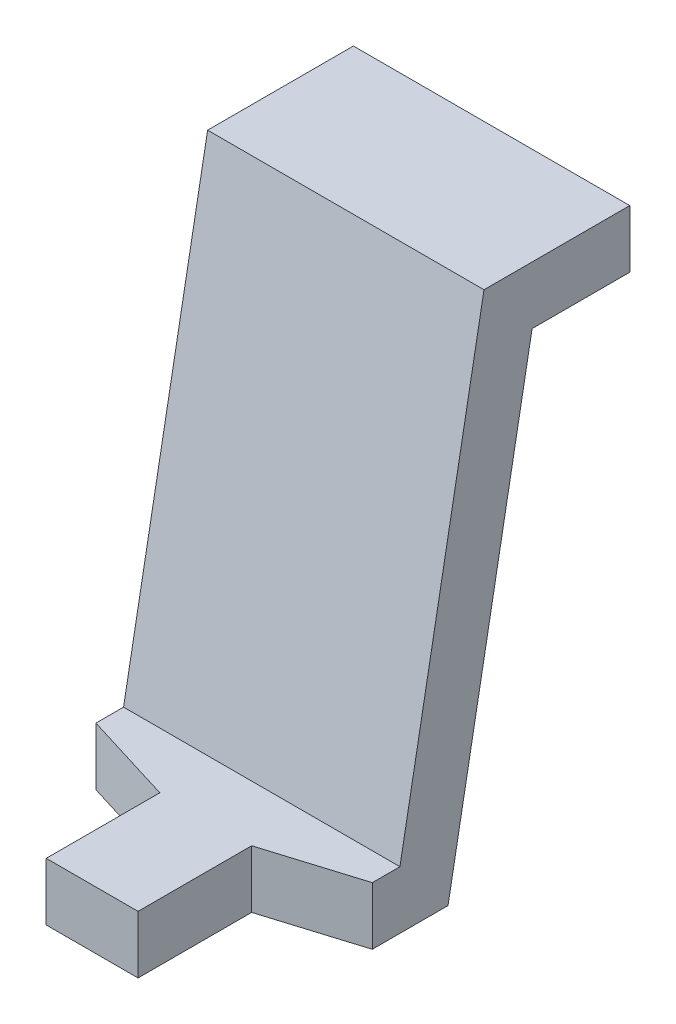
ISO-10303-21;
HEADER;
FILE_DESCRIPTION(('STEP AP214'),'2;1');
FILE_NAME('part.step','',(''),(''),'','','');
FILE_SCHEMA(('AUTOMOTIVE_DESIGN { 1 0 10303 214 1 1 1 1 }'));
ENDSEC;
DATA;
#1=APPLICATION_CONTEXT('core data for automotive mechanical design processes');
#2=APPLICATION_PROTOCOL_DEFINITION('international standard','automotive_design',2000,#1);
#3=PRODUCT_CONTEXT('',#1,'mechanical');
#4=PRODUCT('Part','Part','',(#3));
#5=PRODUCT_RELATED_PRODUCT_CATEGORY('part','',(#4));
#6=PRODUCT_DEFINITION_FORMATION('','',#4);
#7=PRODUCT_DEFINITION_CONTEXT('part definition',#1,'design');
#8=PRODUCT_DEFINITION('design','',#6,#7);
#9=PRODUCT_DEFINITION_SHAPE('','',#8);
#10=(LENGTH_UNIT() NAMED_UNIT(*) SI_UNIT(.MILLI.,.METRE.));
#11=(NAMED_UNIT(*) PLANE_ANGLE_UNIT() SI_UNIT($,.RADIAN.));
#12=(NAMED_UNIT(*) SI_UNIT($,.STERADIAN.) SOLID_ANGLE_UNIT());
#13=UNCERTAINTY_MEASURE_WITH_UNIT(LENGTH_MEASURE(1.E-05),#10,'distance_accuracy_value','');
#14=(GEOMETRIC_REPRESENTATION_CONTEXT(3) GLOBAL_UNCERTAINTY_ASSIGNED_CONTEXT((#13)) GLOBAL_UNIT_ASSIGNED_CONTEXT((#10,
#11,#12)) REPRESENTATION_CONTEXT('',''));
#15=CARTESIAN_POINT('',(0.,0.,0.));
#16=DIRECTION('',(0.,0.,1.));
#17=DIRECTION('',(1.,0.,0.));
#18=AXIS2_PLACEMENT_3D('',#15,#16,#17);
#19=CARTESIAN_POINT('',(0.4875,-2.7225,1.91));
#20=DIRECTION('',(1.,0.,0.));
#21=DIRECTION('',(0.,0.,-1.));
#22=AXIS2_PLACEMENT_3D('',#19,#20,#21);
#23=PLANE('',#22);
#24=DIRECTION('',(0.,0.,-1.));
#25=VECTOR('',#24,1.);
#26=CARTESIAN_POINT('',(0.4875,-2.4175,1.91));
#27=LINE('',#26,#25);
#28=CARTESIAN_POINT('',(0.4875,-2.4175,1.91));
#29=VERTEX_POINT('',#28);
#30=CARTESIAN_POINT('',(0.4875,-2.4175,1.31));
#31=VERTEX_POINT('',#30);
#32=EDGE_CURVE('E191',#29,#31,#27,.T.);
#33=ORIENTED_EDGE('',*,*,#32,.T.);
#34=DIRECTION('',(0.,1.,0.));
#35=VECTOR('',#34,1.);
#36=CARTESIAN_POINT('',(0.4875,-2.7225,1.31));
#37=LINE('',#36,#35);
#38=CARTESIAN_POINT('',(0.4875,-2.7225,1.31));
#39=VERTEX_POINT('',#38);
#40=EDGE_CURVE('E11',#39,#31,#37,.T.);
#41=ORIENTED_EDGE('',*,*,#40,.F.);
#42=DIRECTION('',(0.,0.,-1.));
#43=VECTOR('',#42,1.);
#44=CARTESIAN_POINT('',(0.4875,-2.7225,1.91));
#45=LINE('',#44,#43);
#46=CARTESIAN_POINT('',(0.4875,-2.7225,1.91));
#47=VERTEX_POINT('',#46);
#48=EDGE_CURVE('E209',#47,#39,#45,.T.);
#49=ORIENTED_EDGE('',*,*,#48,.F.);
#50=DIRECTION('',(0.,1.,0.));
#51=VECTOR('',#50,1.);
#52=CARTESIAN_POINT('',(0.4875,-2.7225,1.91));
#53=LINE('',#52,#51);
#54=EDGE_CURVE('E199',#47,#29,#53,.T.);
#55=ORIENTED_EDGE('',*,*,#54,.T.);
#56=EDGE_LOOP('',(#33,#41,#49,#55));
#57=FACE_BOUND('',#56,.T.);
#58=ADVANCED_FACE('F17',(#57),#23,.F.);
#59=CARTESIAN_POINT('',(0.4875,-2.7225,1.31));
#60=DIRECTION('',(0.294085848837945,0.,-0.95577900872182));
#61=DIRECTION('',(0.,-1.,0.));
#62=AXIS2_PLACEMENT_3D('',#59,#60,#61);
#63=PLANE('',#62);
#64=DIRECTION('',(-0.95577900872182,0.,-0.294085848837945));
#65=VECTOR('',#64,1.);
#66=CARTESIAN_POINT('',(0.4875,-2.4175,1.31));
#67=LINE('',#66,#65);
#68=CARTESIAN_POINT('',(0.,-2.4175,1.16));
#69=VERTEX_POINT('',#68);
#70=EDGE_CURVE('E183',#31,#69,#67,.T.);
#71=ORIENTED_EDGE('',*,*,#70,.T.);
#72=DIRECTION('',(0.,1.,0.));
#73=VECTOR('',#72,1.);
#74=CARTESIAN_POINT('',(0.,-2.7225,1.16));
#75=LINE('',#74,#73);
#76=CARTESIAN_POINT('',(0.,-2.7225,1.16));
#77=VERTEX_POINT('',#76);
#78=EDGE_CURVE('E145',#77,#69,#75,.T.);
#79=ORIENTED_EDGE('',*,*,#78,.F.);
#80=DIRECTION('',(-0.95577900872182,0.,-0.294085848837945));
#81=VECTOR('',#80,1.);
#82=CARTESIAN_POINT('',(0.4875,-2.7225,1.31));
#83=LINE('',#82,#81);
#84=EDGE_CURVE('E213',#39,#77,#83,.T.);
#85=ORIENTED_EDGE('',*,*,#84,.F.);
#86=ORIENTED_EDGE('',*,*,#40,.T.);
#87=EDGE_LOOP('',(#71,#79,#85,#86));
#88=FACE_BOUND('',#87,.T.);
#89=ADVANCED_FACE('F19',(#88),#63,.F.);
#90=CARTESIAN_POINT('',(0.9725,-2.7225,1.31));
#91=DIRECTION('',(-0.294085848837945,0.,-0.95577900872182));
#92=DIRECTION('',(-0.95577900872182,0.,0.294085848837945));
#93=AXIS2_PLACEMENT_3D('',#90,#91,#92);
#94=PLANE('',#93);
#95=DIRECTION('',(-0.95577900872182,0.,0.294085848837945));
#96=VECTOR('',#95,1.);
#97=CARTESIAN_POINT('',(0.9725,-2.4175,1.31));
#98=LINE('',#97,#96);
#99=CARTESIAN_POINT('',(1.46,-2.4175,1.16));
#100=VERTEX_POINT('',#99);
#101=CARTESIAN_POINT('',(0.9725,-2.4175,1.31));
#102=VERTEX_POINT('',#101);
#103=EDGE_CURVE('E173',#100,#102,#98,.T.);
#104=ORIENTED_EDGE('',*,*,#103,.T.);
#105=DIRECTION('',(0.,1.,0.));
#106=VECTOR('',#105,1.);
#107=CARTESIAN_POINT('',(0.9725,-2.7225,1.31));
#108=LINE('',#107,#106);
#109=CARTESIAN_POINT('',(0.9725,-2.7225,1.31));
#110=VERTEX_POINT('',#109);
#111=EDGE_CURVE('E21',#110,#102,#108,.T.);
#112=ORIENTED_EDGE('',*,*,#111,.F.);
#113=DIRECTION('',(-0.95577900872182,0.,0.294085848837945));
#114=VECTOR('',#113,1.);
#115=CARTESIAN_POINT('',(0.9725,-2.7225,1.31));
#116=LINE('',#115,#114);
#117=CARTESIAN_POINT('',(1.46,-2.7225,1.16));
#118=VERTEX_POINT('',#117);
#119=EDGE_CURVE('E229',#118,#110,#116,.T.);
#120=ORIENTED_EDGE('',*,*,#119,.F.);
#121=DIRECTION('',(0.,1.,0.));
#122=VECTOR('',#121,1.);
#123=CARTESIAN_POINT('',(1.46,-2.7225,1.16));
#124=LINE('',#123,#122);
#125=EDGE_CURVE('E146',#118,#100,#124,.T.);
#126=ORIENTED_EDGE('',*,*,#125,.T.);
#127=EDGE_LOOP('',(#104,#112,#120,#126));
#128=FACE_BOUND('',#127,.T.);
#129=ADVANCED_FACE('F269',(#128),#94,.F.);
#130=CARTESIAN_POINT('',(0.9725,-2.7225,1.91));
#131=DIRECTION('',(-1.,0.,0.));
#132=DIRECTION('',(0.,0.,1.));
#133=AXIS2_PLACEMENT_3D('',#130,#131,#132);
#134=PLANE('',#133);
#135=DIRECTION('',(0.,0.,1.));
#136=VECTOR('',#135,1.);
#137=CARTESIAN_POINT('',(0.9725,-2.4175,1.91));
#138=LINE('',#137,#136);
#139=CARTESIAN_POINT('',(0.9725,-2.4175,1.91));
#140=VERTEX_POINT('',#139);
#141=EDGE_CURVE('E169',#102,#140,#138,.T.);
#142=ORIENTED_EDGE('',*,*,#141,.T.);
#143=DIRECTION('',(0.,1.,0.));
#144=VECTOR('',#143,1.);
#145=CARTESIAN_POINT('',(0.9725,-2.7225,1.91));
#146=LINE('',#145,#144);
#147=CARTESIAN_POINT('',(0.9725,-2.7225,1.91));
#148=VERTEX_POINT('',#147);
#149=EDGE_CURVE('E206',#148,#140,#146,.T.);
#150=ORIENTED_EDGE('',*,*,#149,.F.);
#151=DIRECTION('',(0.,0.,1.));
#152=VECTOR('',#151,1.);
#153=CARTESIAN_POINT('',(0.9725,-2.7225,1.91));
#154=LINE('',#153,#152);
#155=EDGE_CURVE('E233',#110,#148,#154,.T.);
#156=ORIENTED_EDGE('',*,*,#155,.F.);
#157=ORIENTED_EDGE('',*,*,#111,.T.);
#158=EDGE_LOOP('',(#142,#150,#156,#157));
#159=FACE_BOUND('',#158,.T.);
#160=ADVANCED_FACE('F262',(#159),#134,.F.);
#161=CARTESIAN_POINT('',(0.,-0.305,-0.2));
#162=DIRECTION('',(0.,0.,1.));
#163=DIRECTION('',(1.,0.,0.));
#164=AXIS2_PLACEMENT_3D('',#161,#162,#163);
#165=PLANE('',#164);
#166=DIRECTION('',(0.,1.,0.));
#167=VECTOR('',#166,1.);
#168=CARTESIAN_POINT('',(0.,0.,-0.2));
#169=LINE('',#168,#167);
#170=CARTESIAN_POINT('',(0.,-0.305,-0.2));
#171=VERTEX_POINT('',#170);
#172=CARTESIAN_POINT('',(0.,0.,-0.2));
#173=VERTEX_POINT('',#172);
#174=EDGE_CURVE('E49',#171,#173,#169,.T.);
#175=ORIENTED_EDGE('',*,*,#174,.T.);
#176=DIRECTION('',(1.,0.,0.));
#177=VECTOR('',#176,1.);
#178=CARTESIAN_POINT('',(0.,0.,-0.2));
#179=LINE('',#178,#177);
#180=CARTESIAN_POINT('',(1.46,0.,-0.2));
#181=VERTEX_POINT('',#180);
#182=EDGE_CURVE('E149',#173,#181,#179,.T.);
#183=ORIENTED_EDGE('',*,*,#182,.T.);
#184=DIRECTION('',(0.,-1.,0.));
#185=VECTOR('',#184,1.);
#186=CARTESIAN_POINT('',(1.46,0.,-0.2));
#187=LINE('',#186,#185);
#188=CARTESIAN_POINT('',(1.46,-0.305,-0.2));
#189=VERTEX_POINT('',#188);
#190=EDGE_CURVE('E39',#181,#189,#187,.T.);
#191=ORIENTED_EDGE('',*,*,#190,.T.);
#192=DIRECTION('',(-1.,0.,0.));
#193=VECTOR('',#192,1.);
#194=CARTESIAN_POINT('',(0.,-0.305,-0.2));
#195=LINE('',#194,#193);
#196=EDGE_CURVE('E187',#189,#171,#195,.T.);
#197=ORIENTED_EDGE('',*,*,#196,.T.);
#198=EDGE_LOOP('',(#175,#183,#191,#197));
#199=FACE_BOUND('',#198,.T.);
#200=ADVANCED_FACE('F150',(#199),#165,.F.);
#201=CARTESIAN_POINT('',(0.,0.,0.));
#202=DIRECTION('',(1.,0.,0.));
#203=DIRECTION('',(0.,1.,0.));
#204=AXIS2_PLACEMENT_3D('',#201,#202,#203);
#205=PLANE('',#204);
#206=DIRECTION('',(0.,0.,-1.));
#207=VECTOR('',#206,1.);
#208=CARTESIAN_POINT('',(0.,-2.7225,1.91));
#209=LINE('',#208,#207);
#210=CARTESIAN_POINT('',(0.,-2.7225,0.76));
#211=VERTEX_POINT('',#210);
#212=EDGE_CURVE('E216',#77,#211,#209,.T.);
#213=ORIENTED_EDGE('',*,*,#212,.F.);
#214=ORIENTED_EDGE('',*,*,#78,.T.);
#215=DIRECTION('',(0.,0.,1.));
#216=VECTOR('',#215,1.);
#217=CARTESIAN_POINT('',(0.,-2.4175,1.014076867959));
#218=LINE('',#217,#216);
#219=CARTESIAN_POINT('',(0.,-2.4175,1.014076867959));
#220=VERTEX_POINT('',#219);
#221=EDGE_CURVE('E179',#220,#69,#218,.T.);
#222=ORIENTED_EDGE('',*,*,#221,.F.);
#223=DIRECTION('',(0.,-0.983543822347074,0.180669724976013));
#224=VECTOR('',#223,1.);
#225=CARTESIAN_POINT('',(0.,0.,0.57));
#226=LINE('',#225,#224);
#227=CARTESIAN_POINT('',(0.,0.,0.57));
#228=VERTEX_POINT('',#227);
#229=EDGE_CURVE('E154',#228,#220,#226,.T.);
#230=ORIENTED_EDGE('',*,*,#229,.F.);
#231=DIRECTION('',(0.,0.,1.));
#232=VECTOR('',#231,1.);
#233=CARTESIAN_POINT('',(0.,0.,0.));
#234=LINE('',#233,#232);
#235=EDGE_CURVE('E165',#173,#228,#234,.T.);
#236=ORIENTED_EDGE('',*,*,#235,.F.);
#237=ORIENTED_EDGE('',*,*,#174,.F.);
#238=DIRECTION('',(0.,0.,-1.));
#239=VECTOR('',#238,1.);
#240=CARTESIAN_POINT('',(0.,-0.305,0.315923132041));
#241=LINE('',#240,#239);
#242=CARTESIAN_POINT('',(0.,-0.305,0.315923132041));
#243=VERTEX_POINT('',#242);
#244=EDGE_CURVE('E243',#243,#171,#241,.T.);
#245=ORIENTED_EDGE('',*,*,#244,.F.);
#246=DIRECTION('',(0.,0.983543822347074,-0.180669724976013));
#247=VECTOR('',#246,1.);
#248=CARTESIAN_POINT('',(0.,-2.7225,0.76));
#249=LINE('',#248,#247);
#250=EDGE_CURVE('E236',#211,#243,#249,.T.);
#251=ORIENTED_EDGE('',*,*,#250,.F.);
#252=EDGE_LOOP('',(#213,#214,#222,#230,#236,#237,#245,#251));
#253=FACE_BOUND('',#252,.T.);
#254=ADVANCED_FACE('F291',(#253),#205,.F.);
#255=CARTESIAN_POINT('',(1.46,0.,0.));
#256=DIRECTION('',(1.,0.,0.));
#257=DIRECTION('',(0.,1.,0.));
#258=AXIS2_PLACEMENT_3D('',#255,#256,#257);
#259=PLANE('',#258);
#260=ORIENTED_EDGE('',*,*,#125,.F.);
#261=DIRECTION('',(0.,0.,-1.));
#262=VECTOR('',#261,1.);
#263=CARTESIAN_POINT('',(1.46,-2.7225,1.91));
#264=LINE('',#263,#262);
#265=CARTESIAN_POINT('',(1.46,-2.7225,0.76));
#266=VERTEX_POINT('',#265);
#267=EDGE_CURVE('E225',#118,#266,#264,.T.);
#268=ORIENTED_EDGE('',*,*,#267,.T.);
#269=DIRECTION('',(0.,0.983543822347074,-0.180669724976013));
#270=VECTOR('',#269,1.);
#271=CARTESIAN_POINT('',(1.46,-2.7225,0.76));
#272=LINE('',#271,#270);
#273=CARTESIAN_POINT('',(1.46,-0.305,0.315923132041));
#274=VERTEX_POINT('',#273);
#275=EDGE_CURVE('E244',#266,#274,#272,.T.);
#276=ORIENTED_EDGE('',*,*,#275,.T.);
#277=DIRECTION('',(0.,0.,-1.));
#278=VECTOR('',#277,1.);
#279=CARTESIAN_POINT('',(1.46,-0.305,0.315923132041));
#280=LINE('',#279,#278);
#281=EDGE_CURVE('E142',#274,#189,#280,.T.);
#282=ORIENTED_EDGE('',*,*,#281,.T.);
#283=ORIENTED_EDGE('',*,*,#190,.F.);
#284=DIRECTION('',(0.,0.,1.));
#285=VECTOR('',#284,1.);
#286=CARTESIAN_POINT('',(1.46,0.,0.));
#287=LINE('',#286,#285);
#288=CARTESIAN_POINT('',(1.46,0.,0.57));
#289=VERTEX_POINT('',#288);
#290=EDGE_CURVE('E139',#181,#289,#287,.T.);
#291=ORIENTED_EDGE('',*,*,#290,.T.);
#292=DIRECTION('',(0.,-0.983543822347074,0.180669724976013));
#293=VECTOR('',#292,1.);
#294=CARTESIAN_POINT('',(1.46,0.,0.57));
#295=LINE('',#294,#293);
#296=CARTESIAN_POINT('',(1.46,-2.4175,1.014076867959));
#297=VERTEX_POINT('',#296);
#298=EDGE_CURVE('E184',#289,#297,#295,.T.);
#299=ORIENTED_EDGE('',*,*,#298,.T.);
#300=DIRECTION('',(0.,0.,1.));
#301=VECTOR('',#300,1.);
#302=CARTESIAN_POINT('',(1.46,-2.4175,1.014076867959));
#303=LINE('',#302,#301);
#304=EDGE_CURVE('E195',#297,#100,#303,.T.);
#305=ORIENTED_EDGE('',*,*,#304,.T.);
#306=EDGE_LOOP('',(#260,#268,#276,#282,#283,#291,#299,#305));
#307=FACE_BOUND('',#306,.T.);
#308=ADVANCED_FACE('F136',(#307),#259,.T.);
#309=CARTESIAN_POINT('',(1.46,-0.305,0.315923132041));
#310=DIRECTION('',(0.,1.,0.));
#311=DIRECTION('',(1.,0.,0.));
#312=AXIS2_PLACEMENT_3D('',#309,#310,#311);
#313=PLANE('',#312);
#314=ORIENTED_EDGE('',*,*,#244,.T.);
#315=ORIENTED_EDGE('',*,*,#196,.F.);
#316=ORIENTED_EDGE('',*,*,#281,.F.);
#317=DIRECTION('',(-1.,0.,0.));
#318=VECTOR('',#317,1.);
#319=CARTESIAN_POINT('',(1.46,-0.305,0.315923132041));
#320=LINE('',#319,#318);
#321=EDGE_CURVE('E240',#274,#243,#320,.T.);
#322=ORIENTED_EDGE('',*,*,#321,.T.);
#323=EDGE_LOOP('',(#314,#315,#316,#322));
#324=FACE_BOUND('',#323,.T.);
#325=ADVANCED_FACE('F308',(#324),#313,.F.);
#326=CARTESIAN_POINT('',(1.46,-2.7225,0.76));
#327=DIRECTION('',(0.,0.180669724976013,0.983543822347074));
#328=DIRECTION('',(1.,0.,0.));
#329=AXIS2_PLACEMENT_3D('',#326,#327,#328);
#330=PLANE('',#329);
#331=ORIENTED_EDGE('',*,*,#250,.T.);
#332=ORIENTED_EDGE('',*,*,#321,.F.);
#333=ORIENTED_EDGE('',*,*,#275,.F.);
#334=DIRECTION('',(-1.,0.,0.));
#335=VECTOR('',#334,1.);
#336=CARTESIAN_POINT('',(1.46,-2.7225,0.76));
#337=LINE('',#336,#335);
#338=EDGE_CURVE('E221',#266,#211,#337,.T.);
#339=ORIENTED_EDGE('',*,*,#338,.T.);
#340=EDGE_LOOP('',(#331,#332,#333,#339));
#341=FACE_BOUND('',#340,.T.);
#342=ADVANCED_FACE('F310',(#341),#330,.F.);
#343=CARTESIAN_POINT('',(1.46,-2.7225,1.91));
#344=DIRECTION('',(0.,1.,0.));
#345=DIRECTION('',(1.,0.,0.));
#346=AXIS2_PLACEMENT_3D('',#343,#344,#345);
#347=PLANE('',#346);
#348=ORIENTED_EDGE('',*,*,#48,.T.);
#349=ORIENTED_EDGE('',*,*,#84,.T.);
#350=ORIENTED_EDGE('',*,*,#212,.T.);
#351=ORIENTED_EDGE('',*,*,#338,.F.);
#352=ORIENTED_EDGE('',*,*,#267,.F.);
#353=ORIENTED_EDGE('',*,*,#119,.T.);
#354=ORIENTED_EDGE('',*,*,#155,.T.);
#355=DIRECTION('',(-1.,0.,0.));
#356=VECTOR('',#355,1.);
#357=CARTESIAN_POINT('',(1.46,-2.7225,1.91));
#358=LINE('',#357,#356);
#359=EDGE_CURVE('E202',#148,#47,#358,.T.);
#360=ORIENTED_EDGE('',*,*,#359,.T.);
#361=EDGE_LOOP('',(#348,#349,#350,#351,#352,#353,#354,#360));
#362=FACE_BOUND('',#361,.T.);
#363=ADVANCED_FACE('F281',(#362),#347,.F.);
#364=CARTESIAN_POINT('',(1.46,-2.4175,1.91));
#365=DIRECTION('',(0.,0.,-1.));
#366=DIRECTION('',(-1.,0.,0.));
#367=AXIS2_PLACEMENT_3D('',#364,#365,#366);
#368=PLANE('',#367);
#369=DIRECTION('',(-1.,0.,0.));
#370=VECTOR('',#369,1.);
#371=CARTESIAN_POINT('',(1.46,-2.4175,1.91));
#372=LINE('',#371,#370);
#373=EDGE_CURVE('E174',#140,#29,#372,.T.);
#374=ORIENTED_EDGE('',*,*,#373,.T.);
#375=ORIENTED_EDGE('',*,*,#54,.F.);
#376=ORIENTED_EDGE('',*,*,#359,.F.);
#377=ORIENTED_EDGE('',*,*,#149,.T.);
#378=EDGE_LOOP('',(#374,#375,#376,#377));
#379=FACE_BOUND('',#378,.T.);
#380=ADVANCED_FACE('F278',(#379),#368,.F.);
#381=CARTESIAN_POINT('',(1.46,-2.4175,1.014076867959));
#382=DIRECTION('',(0.,-1.,0.));
#383=DIRECTION('',(0.,0.,-1.));
#384=AXIS2_PLACEMENT_3D('',#381,#382,#383);
#385=PLANE('',#384);
#386=ORIENTED_EDGE('',*,*,#221,.T.);
#387=ORIENTED_EDGE('',*,*,#70,.F.);
#388=ORIENTED_EDGE('',*,*,#32,.F.);
#389=ORIENTED_EDGE('',*,*,#373,.F.);
#390=ORIENTED_EDGE('',*,*,#141,.F.);
#391=ORIENTED_EDGE('',*,*,#103,.F.);
#392=ORIENTED_EDGE('',*,*,#304,.F.);
#393=DIRECTION('',(-1.,0.,0.));
#394=VECTOR('',#393,1.);
#395=CARTESIAN_POINT('',(1.46,-2.4175,1.014076867959));
#396=LINE('',#395,#394);
#397=EDGE_CURVE('E178',#297,#220,#396,.T.);
#398=ORIENTED_EDGE('',*,*,#397,.T.);
#399=EDGE_LOOP('',(#386,#387,#388,#389,#390,#391,#392,#398));
#400=FACE_BOUND('',#399,.T.);
#401=ADVANCED_FACE('F273',(#400),#385,.F.);
#402=CARTESIAN_POINT('',(1.46,0.,0.57));
#403=DIRECTION('',(0.,-0.180669724976013,-0.983543822347074));
#404=DIRECTION('',(0.,-0.983543822347074,0.180669724976013));
#405=AXIS2_PLACEMENT_3D('',#402,#403,#404);
#406=PLANE('',#405);
#407=ORIENTED_EDGE('',*,*,#229,.T.);
#408=ORIENTED_EDGE('',*,*,#397,.F.);
#409=ORIENTED_EDGE('',*,*,#298,.F.);
#410=DIRECTION('',(-1.,0.,0.));
#411=VECTOR('',#410,1.);
#412=CARTESIAN_POINT('',(1.46,0.,0.57));
#413=LINE('',#412,#411);
#414=EDGE_CURVE('E158',#289,#228,#413,.T.);
#415=ORIENTED_EDGE('',*,*,#414,.T.);
#416=EDGE_LOOP('',(#407,#408,#409,#415));
#417=FACE_BOUND('',#416,.T.);
#418=ADVANCED_FACE('F289',(#417),#406,.F.);
#419=CARTESIAN_POINT('',(1.46,0.,0.));
#420=DIRECTION('',(0.,-1.,0.));
#421=DIRECTION('',(0.,0.,-1.));
#422=AXIS2_PLACEMENT_3D('',#419,#420,#421);
#423=PLANE('',#422);
#424=ORIENTED_EDGE('',*,*,#235,.T.);
#425=ORIENTED_EDGE('',*,*,#414,.F.);
#426=ORIENTED_EDGE('',*,*,#290,.F.);
#427=ORIENTED_EDGE('',*,*,#182,.F.);
#428=EDGE_LOOP('',(#424,#425,#426,#427));
#429=FACE_BOUND('',#428,.T.);
#430=ADVANCED_FACE('F156',(#429),#423,.F.);
#431=CLOSED_SHELL('',(#58,#89,#129,#160,#200,#254,#308,#325,#342,#363,#380,#401,#418,#430));
#432=MANIFOLD_SOLID_BREP('B1',#431);
#433=ADVANCED_BREP_SHAPE_REPRESENTATION('',(#18,#432),#14);
#434=SHAPE_DEFINITION_REPRESENTATION(#9,#433);
ENDSEC;
END-ISO-10303-21;
